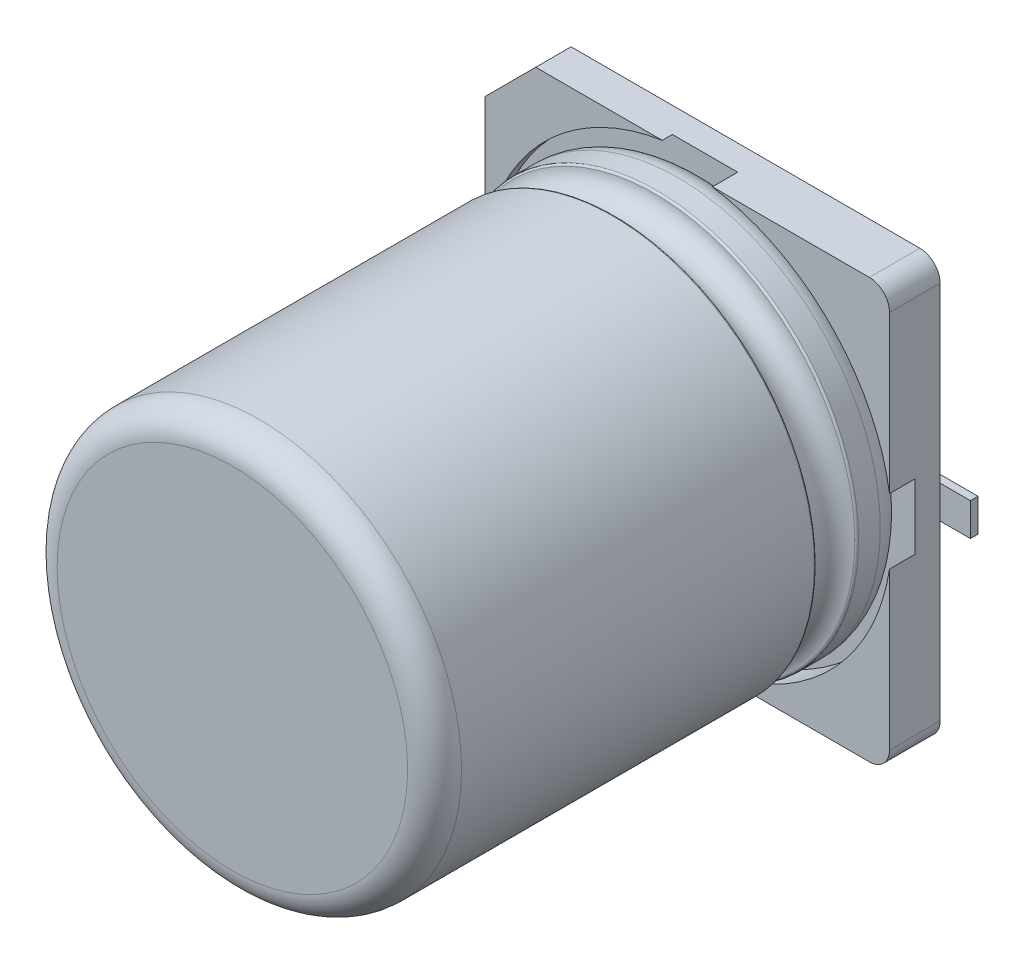
ISO-10303-21;
HEADER;
FILE_DESCRIPTION(('STEP AP214'),'2;1');
FILE_NAME('part.step','',(''),(''),'','','');
FILE_SCHEMA(('AUTOMOTIVE_DESIGN { 1 0 10303 214 1 1 1 1 }'));
ENDSEC;
DATA;
#1=APPLICATION_CONTEXT('core data for automotive mechanical design processes');
#2=APPLICATION_PROTOCOL_DEFINITION('international standard','automotive_design',2000,#1);
#3=PRODUCT_CONTEXT('',#1,'mechanical');
#4=PRODUCT('Part','Part','',(#3));
#5=PRODUCT_RELATED_PRODUCT_CATEGORY('part','',(#4));
#6=PRODUCT_DEFINITION_FORMATION('','',#4);
#7=PRODUCT_DEFINITION_CONTEXT('part definition',#1,'design');
#8=PRODUCT_DEFINITION('design','',#6,#7);
#9=PRODUCT_DEFINITION_SHAPE('','',#8);
#10=(LENGTH_UNIT() NAMED_UNIT(*) SI_UNIT(.MILLI.,.METRE.));
#11=(NAMED_UNIT(*) PLANE_ANGLE_UNIT() SI_UNIT($,.RADIAN.));
#12=(NAMED_UNIT(*) SI_UNIT($,.STERADIAN.) SOLID_ANGLE_UNIT());
#13=UNCERTAINTY_MEASURE_WITH_UNIT(LENGTH_MEASURE(1.E-05),#10,'distance_accuracy_value','');
#14=(GEOMETRIC_REPRESENTATION_CONTEXT(3) GLOBAL_UNCERTAINTY_ASSIGNED_CONTEXT((#13)) GLOBAL_UNIT_ASSIGNED_CONTEXT((#10,
#11,#12)) REPRESENTATION_CONTEXT('',''));
#15=CARTESIAN_POINT('',(0.,0.,0.));
#16=DIRECTION('',(0.,0.,1.));
#17=DIRECTION('',(1.,0.,0.));
#18=AXIS2_PLACEMENT_3D('',#15,#16,#17);
#19=CARTESIAN_POINT('',(0.,0.,2.45));
#20=DIRECTION('',(0.,0.,-1.));
#21=DIRECTION('',(-1.,0.,0.));
#22=AXIS2_PLACEMENT_3D('',#19,#20,#21);
#23=CYLINDRICAL_SURFACE('',#22,4.);
#24=CARTESIAN_POINT('',(0.,0.,9.466666666677));
#25=DIRECTION('',(0.,0.,-1.));
#26=DIRECTION('',(-1.,0.,0.));
#27=AXIS2_PLACEMENT_3D('',#24,#25,#26);
#28=CIRCLE('',#27,4.);
#29=CARTESIAN_POINT('',(-4.00000000001,1.00004898587197E-11,9.466666666677));
#30=VERTEX_POINT('',#29);
#31=EDGE_CURVE('E29',#30,#30,#28,.T.);
#32=ORIENTED_EDGE('',*,*,#31,.T.);
#33=EDGE_LOOP('',(#32));
#34=FACE_BOUND('',#33,.T.);
#35=CARTESIAN_POINT('',(0.,0.,2.48817804600402));
#36=DIRECTION('',(0.,0.,-1.));
#37=DIRECTION('',(-1.,-4.06789841388464E-12,0.));
#38=AXIS2_PLACEMENT_3D('',#35,#36,#37);
#39=CIRCLE('',#38,3.99998270484787);
#40=CARTESIAN_POINT('',(-3.99998299098902,-1.62657901973409E-11,2.488178046004));
#41=VERTEX_POINT('',#40);
#42=EDGE_CURVE('E333',#41,#41,#39,.T.);
#43=ORIENTED_EDGE('',*,*,#42,.F.);
#44=EDGE_LOOP('',(#43));
#45=FACE_BOUND('',#44,.T.);
#46=ADVANCED_FACE('F17',(#34,#45),#23,.T.);
#47=CARTESIAN_POINT('',(0.,0.,10.));
#48=DIRECTION('',(0.,0.,-1.));
#49=DIRECTION('',(0.,-1.,0.));
#50=AXIS2_PLACEMENT_3D('',#47,#48,#49);
#51=PLANE('',#50);
#52=CARTESIAN_POINT('',(0.,0.,10.00000000001));
#53=DIRECTION('',(0.,0.,-1.));
#54=DIRECTION('',(-1.,0.,0.));
#55=AXIS2_PLACEMENT_3D('',#52,#53,#54);
#56=CIRCLE('',#55,3.4666667);
#57=CARTESIAN_POINT('',(-3.466666666677,1.00004245442237E-11,10.00000000001));
#58=VERTEX_POINT('',#57);
#59=EDGE_CURVE('E11',#58,#58,#56,.T.);
#60=ORIENTED_EDGE('',*,*,#59,.F.);
#61=EDGE_LOOP('',(#60));
#62=FACE_BOUND('',#61,.T.);
#63=ADVANCED_FACE('F709',(#62),#51,.F.);
#64=CARTESIAN_POINT('',(3.000096934556,0.,0.));
#65=DIRECTION('',(0.,0.,1.));
#66=DIRECTION('',(1.,0.,0.));
#67=AXIS2_PLACEMENT_3D('',#64,#65,#66);
#68=PLANE('',#67);
#69=DIRECTION('',(1.,0.,0.));
#70=VECTOR('',#69,1.);
#71=CARTESIAN_POINT('',(1.42500000001,-0.32500000001,0.));
#72=LINE('',#71,#70);
#73=CARTESIAN_POINT('',(1.425,-0.325,0.));
#74=VERTEX_POINT('',#73);
#75=CARTESIAN_POINT('',(4.75,-0.325,0.));
#76=VERTEX_POINT('',#75);
#77=EDGE_CURVE('E505',#74,#76,#72,.T.);
#78=ORIENTED_EDGE('',*,*,#77,.F.);
#79=CARTESIAN_POINT('',(1.42500000001,-1.0000404535489E-11,0.));
#80=DIRECTION('',(0.,0.,1.));
#81=DIRECTION('',(0.,1.,0.));
#82=AXIS2_PLACEMENT_3D('',#79,#80,#81);
#83=CIRCLE('',#82,0.325);
#84=CARTESIAN_POINT('',(1.425,0.325,0.));
#85=VERTEX_POINT('',#84);
#86=EDGE_CURVE('E438',#85,#74,#83,.T.);
#87=ORIENTED_EDGE('',*,*,#86,.F.);
#88=DIRECTION('',(-1.,0.,0.));
#89=VECTOR('',#88,1.);
#90=CARTESIAN_POINT('',(4.75000000001,0.32500000001,0.));
#91=LINE('',#90,#89);
#92=CARTESIAN_POINT('',(4.75,0.325,0.));
#93=VERTEX_POINT('',#92);
#94=EDGE_CURVE('E408',#93,#85,#91,.T.);
#95=ORIENTED_EDGE('',*,*,#94,.F.);
#96=DIRECTION('',(0.,1.,0.));
#97=VECTOR('',#96,1.);
#98=CARTESIAN_POINT('',(4.75000000001,-0.32500000001,0.));
#99=LINE('',#98,#97);
#100=EDGE_CURVE('E311',#76,#93,#99,.T.);
#101=ORIENTED_EDGE('',*,*,#100,.F.);
#102=EDGE_LOOP('',(#78,#87,#95,#101));
#103=FACE_BOUND('',#102,.T.);
#104=ADVANCED_FACE('F714',(#103),#68,.F.);
#105=CARTESIAN_POINT('',(-3.000096934556,0.,0.));
#106=DIRECTION('',(0.,0.,1.));
#107=DIRECTION('',(1.,0.,0.));
#108=AXIS2_PLACEMENT_3D('',#105,#106,#107);
#109=PLANE('',#108);
#110=DIRECTION('',(-1.,0.,0.));
#111=VECTOR('',#110,1.);
#112=CARTESIAN_POINT('',(-1.42500000001,0.32500000001,0.));
#113=LINE('',#112,#111);
#114=CARTESIAN_POINT('',(-1.425,0.325,0.));
#115=VERTEX_POINT('',#114);
#116=CARTESIAN_POINT('',(-4.75,0.325,0.));
#117=VERTEX_POINT('',#116);
#118=EDGE_CURVE('E419',#115,#117,#113,.T.);
#119=ORIENTED_EDGE('',*,*,#118,.F.);
#120=CARTESIAN_POINT('',(-1.42500000001,1.00002300233201E-11,0.));
#121=DIRECTION('',(0.,0.,1.));
#122=DIRECTION('',(0.,-1.,0.));
#123=AXIS2_PLACEMENT_3D('',#120,#121,#122);
#124=CIRCLE('',#123,0.325);
#125=CARTESIAN_POINT('',(-1.425,-0.325,0.));
#126=VERTEX_POINT('',#125);
#127=EDGE_CURVE('E355',#126,#115,#124,.T.);
#128=ORIENTED_EDGE('',*,*,#127,.F.);
#129=DIRECTION('',(1.,0.,0.));
#130=VECTOR('',#129,1.);
#131=CARTESIAN_POINT('',(-4.75000000001,-0.32500000001,0.));
#132=LINE('',#131,#130);
#133=CARTESIAN_POINT('',(-4.75,-0.325,0.));
#134=VERTEX_POINT('',#133);
#135=EDGE_CURVE('E354',#134,#126,#132,.T.);
#136=ORIENTED_EDGE('',*,*,#135,.F.);
#137=DIRECTION('',(0.,-1.,0.));
#138=VECTOR('',#137,1.);
#139=CARTESIAN_POINT('',(-4.75000000001,0.32500000001,0.));
#140=LINE('',#139,#138);
#141=EDGE_CURVE('E314',#117,#134,#140,.T.);
#142=ORIENTED_EDGE('',*,*,#141,.F.);
#143=EDGE_LOOP('',(#119,#128,#136,#142));
#144=FACE_BOUND('',#143,.T.);
#145=ADVANCED_FACE('F661',(#144),#109,.F.);
#146=CARTESIAN_POINT('',(0.,0.,9.466666666667));
#147=DIRECTION('',(0.,0.,1.));
#148=DIRECTION('',(-1.,0.,0.));
#149=AXIS2_PLACEMENT_3D('',#146,#147,#148);
#150=TOROIDAL_SURFACE('',#149,3.4666667,0.5333333);
#151=ORIENTED_EDGE('',*,*,#59,.T.);
#152=EDGE_LOOP('',(#151));
#153=FACE_BOUND('',#152,.T.);
#154=ORIENTED_EDGE('',*,*,#31,.F.);
#155=EDGE_LOOP('',(#154));
#156=FACE_BOUND('',#155,.T.);
#157=ADVANCED_FACE('F721',(#153,#156),#150,.T.);
#158=CARTESIAN_POINT('',(4.75,-0.325,0.));
#159=DIRECTION('',(-1.,0.,0.));
#160=DIRECTION('',(0.,0.,1.));
#161=AXIS2_PLACEMENT_3D('',#158,#159,#160);
#162=PLANE('',#161);
#163=ORIENTED_EDGE('',*,*,#100,.T.);
#164=DIRECTION('',(0.,0.,1.));
#165=VECTOR('',#164,1.);
#166=CARTESIAN_POINT('',(4.75000000001,0.32500000001,0.));
#167=LINE('',#166,#165);
#168=CARTESIAN_POINT('',(4.75,0.325,0.15));
#169=VERTEX_POINT('',#168);
#170=EDGE_CURVE('E447',#93,#169,#167,.T.);
#171=ORIENTED_EDGE('',*,*,#170,.T.);
#172=DIRECTION('',(0.,1.,0.));
#173=VECTOR('',#172,1.);
#174=CARTESIAN_POINT('',(4.75000000001,-0.32500000001,0.15000000001));
#175=LINE('',#174,#173);
#176=CARTESIAN_POINT('',(4.75,-0.325,0.15));
#177=VERTEX_POINT('',#176);
#178=EDGE_CURVE('E468',#177,#169,#175,.T.);
#179=ORIENTED_EDGE('',*,*,#178,.F.);
#180=DIRECTION('',(0.,0.,1.));
#181=VECTOR('',#180,1.);
#182=CARTESIAN_POINT('',(4.75000000001,-0.32500000001,0.));
#183=LINE('',#182,#181);
#184=EDGE_CURVE('E506',#76,#177,#183,.T.);
#185=ORIENTED_EDGE('',*,*,#184,.F.);
#186=EDGE_LOOP('',(#163,#171,#179,#185));
#187=FACE_BOUND('',#186,.T.);
#188=ADVANCED_FACE('F381',(#187),#162,.F.);
#189=CARTESIAN_POINT('',(-4.75,0.325,0.));
#190=DIRECTION('',(1.,0.,0.));
#191=DIRECTION('',(0.,-1.,0.));
#192=AXIS2_PLACEMENT_3D('',#189,#190,#191);
#193=PLANE('',#192);
#194=ORIENTED_EDGE('',*,*,#141,.T.);
#195=DIRECTION('',(0.,0.,1.));
#196=VECTOR('',#195,1.);
#197=CARTESIAN_POINT('',(-4.75000000001,-0.32500000001,0.));
#198=LINE('',#197,#196);
#199=CARTESIAN_POINT('',(-4.75,-0.325,0.15));
#200=VERTEX_POINT('',#199);
#201=EDGE_CURVE('E434',#134,#200,#198,.T.);
#202=ORIENTED_EDGE('',*,*,#201,.T.);
#203=DIRECTION('',(0.,-1.,0.));
#204=VECTOR('',#203,1.);
#205=CARTESIAN_POINT('',(-4.75000000001,0.32500000001,0.15000000001));
#206=LINE('',#205,#204);
#207=CARTESIAN_POINT('',(-4.75,0.325,0.15));
#208=VERTEX_POINT('',#207);
#209=EDGE_CURVE('E496',#208,#200,#206,.T.);
#210=ORIENTED_EDGE('',*,*,#209,.F.);
#211=DIRECTION('',(0.,0.,1.));
#212=VECTOR('',#211,1.);
#213=CARTESIAN_POINT('',(-4.75000000001,0.32500000001,0.));
#214=LINE('',#213,#212);
#215=EDGE_CURVE('E310',#117,#208,#214,.T.);
#216=ORIENTED_EDGE('',*,*,#215,.F.);
#217=EDGE_LOOP('',(#194,#202,#210,#216));
#218=FACE_BOUND('',#217,.T.);
#219=ADVANCED_FACE('F666',(#218),#193,.F.);
#220=CARTESIAN_POINT('',(1.425,-0.325,0.));
#221=DIRECTION('',(0.,1.,0.));
#222=DIRECTION('',(0.,0.,-1.));
#223=AXIS2_PLACEMENT_3D('',#220,#221,#222);
#224=PLANE('',#223);
#225=ORIENTED_EDGE('',*,*,#77,.T.);
#226=ORIENTED_EDGE('',*,*,#184,.T.);
#227=DIRECTION('',(1.,0.,0.));
#228=VECTOR('',#227,1.);
#229=CARTESIAN_POINT('',(1.42500000001,-0.32500000001,0.15000000001));
#230=LINE('',#229,#228);
#231=CARTESIAN_POINT('',(4.15,-0.325,0.15));
#232=VERTEX_POINT('',#231);
#233=EDGE_CURVE('E571',#232,#177,#230,.T.);
#234=ORIENTED_EDGE('',*,*,#233,.F.);
#235=DIRECTION('',(1.,0.,0.));
#236=VECTOR('',#235,1.);
#237=CARTESIAN_POINT('',(1.42500000001,-0.32500000001,0.15000000001));
#238=LINE('',#237,#236);
#239=CARTESIAN_POINT('',(1.425,-0.325,0.15));
#240=VERTEX_POINT('',#239);
#241=EDGE_CURVE('E458',#240,#232,#238,.T.);
#242=ORIENTED_EDGE('',*,*,#241,.F.);
#243=DIRECTION('',(0.,0.,1.));
#244=VECTOR('',#243,1.);
#245=CARTESIAN_POINT('',(1.42500000001,-0.32500000001,0.));
#246=LINE('',#245,#244);
#247=EDGE_CURVE('E502',#74,#240,#246,.T.);
#248=ORIENTED_EDGE('',*,*,#247,.F.);
#249=EDGE_LOOP('',(#225,#226,#234,#242,#248));
#250=FACE_BOUND('',#249,.T.);
#251=ADVANCED_FACE('F932',(#250),#224,.F.);
#252=CARTESIAN_POINT('',(1.425,0.,0.));
#253=DIRECTION('',(0.,0.,1.));
#254=DIRECTION('',(0.,1.,0.));
#255=AXIS2_PLACEMENT_3D('',#252,#253,#254);
#256=CYLINDRICAL_SURFACE('',#255,0.325);
#257=ORIENTED_EDGE('',*,*,#86,.T.);
#258=ORIENTED_EDGE('',*,*,#247,.T.);
#259=CARTESIAN_POINT('',(1.42500000001,-1.0000404535489E-11,0.15000000001));
#260=DIRECTION('',(0.,0.,1.));
#261=DIRECTION('',(0.,1.,0.));
#262=AXIS2_PLACEMENT_3D('',#259,#260,#261);
#263=CIRCLE('',#262,0.325);
#264=CARTESIAN_POINT('',(1.425,0.325,0.15));
#265=VERTEX_POINT('',#264);
#266=EDGE_CURVE('E479',#265,#240,#263,.T.);
#267=ORIENTED_EDGE('',*,*,#266,.F.);
#268=DIRECTION('',(0.,0.,1.));
#269=VECTOR('',#268,1.);
#270=CARTESIAN_POINT('',(1.42500000001,0.32500000001,0.));
#271=LINE('',#270,#269);
#272=EDGE_CURVE('E404',#85,#265,#271,.T.);
#273=ORIENTED_EDGE('',*,*,#272,.F.);
#274=EDGE_LOOP('',(#257,#258,#267,#273));
#275=FACE_BOUND('',#274,.T.);
#276=ADVANCED_FACE('F927',(#275),#256,.T.);
#277=CARTESIAN_POINT('',(-4.75,-0.325,0.));
#278=DIRECTION('',(0.,1.,0.));
#279=DIRECTION('',(0.,0.,-1.));
#280=AXIS2_PLACEMENT_3D('',#277,#278,#279);
#281=PLANE('',#280);
#282=ORIENTED_EDGE('',*,*,#135,.T.);
#283=DIRECTION('',(0.,0.,1.));
#284=VECTOR('',#283,1.);
#285=CARTESIAN_POINT('',(-1.42500000001,-0.32500000001,0.));
#286=LINE('',#285,#284);
#287=CARTESIAN_POINT('',(-1.425,-0.325,0.15));
#288=VERTEX_POINT('',#287);
#289=EDGE_CURVE('E414',#126,#288,#286,.T.);
#290=ORIENTED_EDGE('',*,*,#289,.T.);
#291=DIRECTION('',(1.,0.,0.));
#292=VECTOR('',#291,1.);
#293=CARTESIAN_POINT('',(-4.75000000001,-0.32500000001,0.15000000001));
#294=LINE('',#293,#292);
#295=CARTESIAN_POINT('',(-4.15,-0.325,0.15));
#296=VERTEX_POINT('',#295);
#297=EDGE_CURVE('E415',#296,#288,#294,.T.);
#298=ORIENTED_EDGE('',*,*,#297,.F.);
#299=DIRECTION('',(1.,0.,0.));
#300=VECTOR('',#299,1.);
#301=CARTESIAN_POINT('',(-4.75000000001,-0.32500000001,0.15000000001));
#302=LINE('',#301,#300);
#303=EDGE_CURVE('E500',#200,#296,#302,.T.);
#304=ORIENTED_EDGE('',*,*,#303,.F.);
#305=ORIENTED_EDGE('',*,*,#201,.F.);
#306=EDGE_LOOP('',(#282,#290,#298,#304,#305));
#307=FACE_BOUND('',#306,.T.);
#308=ADVANCED_FACE('F676',(#307),#281,.F.);
#309=CARTESIAN_POINT('',(0.,0.,1.183333333333));
#310=DIRECTION('',(0.,0.,-1.));
#311=DIRECTION('',(-1.,0.,0.));
#312=AXIS2_PLACEMENT_3D('',#309,#310,#311);
#313=TOROIDAL_SURFACE('',#312,3.4666667,0.5333333);
#314=CARTESIAN_POINT('',(0.,0.,0.65000000001));
#315=DIRECTION('',(0.,0.,-1.));
#316=DIRECTION('',(-1.,0.,0.));
#317=AXIS2_PLACEMENT_3D('',#314,#315,#316);
#318=CIRCLE('',#317,3.4666667);
#319=CARTESIAN_POINT('',(-3.466666666677,1.00004245442237E-11,0.65000000001));
#320=VERTEX_POINT('',#319);
#321=EDGE_CURVE('E351',#320,#320,#318,.T.);
#322=ORIENTED_EDGE('',*,*,#321,.F.);
#323=EDGE_LOOP('',(#322));
#324=FACE_BOUND('',#323,.T.);
#325=CARTESIAN_POINT('',(0.,0.,1.183333333343));
#326=DIRECTION('',(0.,0.,-1.));
#327=DIRECTION('',(-1.,0.,0.));
#328=AXIS2_PLACEMENT_3D('',#325,#326,#327);
#329=CIRCLE('',#328,4.);
#330=CARTESIAN_POINT('',(-4.00000000001,1.00004898587197E-11,1.183333333343));
#331=VERTEX_POINT('',#330);
#332=EDGE_CURVE('E439',#331,#331,#329,.T.);
#333=ORIENTED_EDGE('',*,*,#332,.T.);
#334=EDGE_LOOP('',(#333));
#335=FACE_BOUND('',#334,.T.);
#336=ADVANCED_FACE('F693',(#324,#335),#313,.T.);
#337=CARTESIAN_POINT('',(0.,0.,0.65));
#338=DIRECTION('',(0.,0.,1.));
#339=DIRECTION('',(0.,-1.,0.));
#340=AXIS2_PLACEMENT_3D('',#337,#338,#339);
#341=PLANE('',#340);
#342=ORIENTED_EDGE('',*,*,#321,.T.);
#343=EDGE_LOOP('',(#342));
#344=FACE_BOUND('',#343,.T.);
#345=DIRECTION('',(0.,-1.,0.));
#346=VECTOR('',#345,1.);
#347=CARTESIAN_POINT('',(-4.15000000001,1.57500000001,0.65000000001));
#348=LINE('',#347,#346);
#349=CARTESIAN_POINT('',(-4.15,0.646142399166,0.65));
#350=VERTEX_POINT('',#349);
#351=CARTESIAN_POINT('',(-4.15,-0.646142399166,0.65));
#352=VERTEX_POINT('',#351);
#353=EDGE_CURVE('E269',#350,#352,#348,.T.);
#354=ORIENTED_EDGE('',*,*,#353,.T.);
#355=CARTESIAN_POINT('',(0.,0.,0.65000000001));
#356=DIRECTION('',(0.,0.,1.));
#357=DIRECTION('',(-1.,0.,0.));
#358=AXIS2_PLACEMENT_3D('',#355,#356,#357);
#359=CIRCLE('',#358,4.2);
#360=CARTESIAN_POINT('',(-0.646142399166,-4.15,0.65));
#361=VERTEX_POINT('',#360);
#362=EDGE_CURVE('E280',#352,#361,#359,.T.);
#363=ORIENTED_EDGE('',*,*,#362,.T.);
#364=DIRECTION('',(1.,0.,0.));
#365=VECTOR('',#364,1.);
#366=CARTESIAN_POINT('',(-1.57500000001,-4.15000000001,0.65000000001));
#367=LINE('',#366,#365);
#368=CARTESIAN_POINT('',(0.646142399166,-4.15,0.65));
#369=VERTEX_POINT('',#368);
#370=EDGE_CURVE('E295',#361,#369,#367,.T.);
#371=ORIENTED_EDGE('',*,*,#370,.T.);
#372=CARTESIAN_POINT('',(0.,0.,0.65000000001));
#373=DIRECTION('',(0.,0.,1.));
#374=DIRECTION('',(-1.,0.,0.));
#375=AXIS2_PLACEMENT_3D('',#372,#373,#374);
#376=CIRCLE('',#375,4.2);
#377=CARTESIAN_POINT('',(4.15,-0.646142399166,0.65));
#378=VERTEX_POINT('',#377);
#379=EDGE_CURVE('E494',#369,#378,#376,.T.);
#380=ORIENTED_EDGE('',*,*,#379,.T.);
#381=DIRECTION('',(0.,1.,0.));
#382=VECTOR('',#381,1.);
#383=CARTESIAN_POINT('',(4.15000000001,-2.07500000001,0.65000000001));
#384=LINE('',#383,#382);
#385=CARTESIAN_POINT('',(4.15,0.646142399166,0.65));
#386=VERTEX_POINT('',#385);
#387=EDGE_CURVE('E495',#378,#386,#384,.T.);
#388=ORIENTED_EDGE('',*,*,#387,.T.);
#389=CARTESIAN_POINT('',(0.,0.,0.65000000001));
#390=DIRECTION('',(0.,0.,1.));
#391=DIRECTION('',(-1.,0.,0.));
#392=AXIS2_PLACEMENT_3D('',#389,#390,#391);
#393=CIRCLE('',#392,4.2);
#394=CARTESIAN_POINT('',(0.646142399166,4.15,0.65));
#395=VERTEX_POINT('',#394);
#396=EDGE_CURVE('E276',#386,#395,#393,.T.);
#397=ORIENTED_EDGE('',*,*,#396,.T.);
#398=DIRECTION('',(-1.,0.,0.));
#399=VECTOR('',#398,1.);
#400=CARTESIAN_POINT('',(2.07500000001,4.15000000001,0.65000000001));
#401=LINE('',#400,#399);
#402=CARTESIAN_POINT('',(-0.646142399166,4.15,0.65));
#403=VERTEX_POINT('',#402);
#404=EDGE_CURVE('E272',#395,#403,#401,.T.);
#405=ORIENTED_EDGE('',*,*,#404,.T.);
#406=CARTESIAN_POINT('',(0.,0.,0.65000000001));
#407=DIRECTION('',(0.,0.,1.));
#408=DIRECTION('',(-1.,0.,0.));
#409=AXIS2_PLACEMENT_3D('',#406,#407,#408);
#410=CIRCLE('',#409,4.2);
#411=EDGE_CURVE('E259',#403,#350,#410,.T.);
#412=ORIENTED_EDGE('',*,*,#411,.T.);
#413=EDGE_LOOP('',(#354,#363,#371,#380,#388,#397,#405,#412));
#414=FACE_BOUND('',#413,.T.);
#415=ADVANCED_FACE('F273',(#344,#414),#341,.T.);
#416=CARTESIAN_POINT('',(0.,0.,2.05000000001));
#417=DIRECTION('',(0.,0.,1.));
#418=DIRECTION('',(1.,0.,0.));
#419=AXIS2_PLACEMENT_3D('',#416,#417,#418);
#420=TOROIDAL_SURFACE('',#419,4.,0.4);
#421=CARTESIAN_POINT('',(0.,0.,2.448343678196));
#422=DIRECTION('',(0.,0.,-1.));
#423=DIRECTION('',(-1.,0.,0.));
#424=AXIS2_PLACEMENT_3D('',#421,#422,#423);
#425=CIRCLE('',#424,3.9636362);
#426=CARTESIAN_POINT('',(-3.963636363646,1.00004854068332E-11,2.448343678196));
#427=VERTEX_POINT('',#426);
#428=EDGE_CURVE('E330',#427,#427,#425,.T.);
#429=ORIENTED_EDGE('',*,*,#428,.T.);
#430=EDGE_LOOP('',(#429));
#431=FACE_BOUND('',#430,.T.);
#432=CARTESIAN_POINT('',(0.,0.,1.651656321824));
#433=DIRECTION('',(0.,0.,-1.));
#434=DIRECTION('',(-1.,0.,0.));
#435=AXIS2_PLACEMENT_3D('',#432,#433,#434);
#436=CIRCLE('',#435,3.9636362);
#437=CARTESIAN_POINT('',(-3.963636363646,1.00004854068332E-11,1.651656321824));
#438=VERTEX_POINT('',#437);
#439=EDGE_CURVE('E433',#438,#438,#436,.T.);
#440=ORIENTED_EDGE('',*,*,#439,.F.);
#441=EDGE_LOOP('',(#440));
#442=FACE_BOUND('',#441,.T.);
#443=ADVANCED_FACE('F19',(#431,#442),#420,.F.);
#444=CARTESIAN_POINT('',(-4.15,3.15,0.15));
#445=DIRECTION('',(1.,0.,0.));
#446=DIRECTION('',(0.,-1.,0.));
#447=AXIS2_PLACEMENT_3D('',#444,#445,#446);
#448=PLANE('',#447);
#449=DIRECTION('',(0.,-1.,0.));
#450=VECTOR('',#449,1.);
#451=CARTESIAN_POINT('',(-4.15000000001,3.15000000001,0.15000000001));
#452=LINE('',#451,#450);
#453=CARTESIAN_POINT('',(-4.15,0.325,0.15));
#454=VERTEX_POINT('',#453);
#455=EDGE_CURVE('E426',#454,#296,#452,.T.);
#456=ORIENTED_EDGE('',*,*,#455,.T.);
#457=DIRECTION('',(0.,-1.,0.));
#458=VECTOR('',#457,1.);
#459=CARTESIAN_POINT('',(-4.15000000001,3.15000000001,0.15000000001));
#460=LINE('',#459,#458);
#461=CARTESIAN_POINT('',(-4.15,-3.15,0.15));
#462=VERTEX_POINT('',#461);
#463=EDGE_CURVE('E418',#296,#462,#460,.T.);
#464=ORIENTED_EDGE('',*,*,#463,.T.);
#465=DIRECTION('',(0.,0.,1.));
#466=VECTOR('',#465,1.);
#467=CARTESIAN_POINT('',(-4.15000000001,-3.15000000001,0.15000000001));
#468=LINE('',#467,#466);
#469=CARTESIAN_POINT('',(-4.15,-3.15,0.85));
#470=VERTEX_POINT('',#469);
#471=EDGE_CURVE('E471',#462,#470,#468,.T.);
#472=ORIENTED_EDGE('',*,*,#471,.T.);
#473=DIRECTION('',(0.,-1.,0.));
#474=VECTOR('',#473,1.);
#475=CARTESIAN_POINT('',(-4.15000000001,4.15000000001,0.85000000001));
#476=LINE('',#475,#474);
#477=CARTESIAN_POINT('',(-4.15,-0.646142399166,0.85));
#478=VERTEX_POINT('',#477);
#479=EDGE_CURVE('E335',#478,#470,#476,.T.);
#480=ORIENTED_EDGE('',*,*,#479,.F.);
#481=DIRECTION('',(0.,0.,-1.));
#482=VECTOR('',#481,1.);
#483=CARTESIAN_POINT('',(-4.15000000001,-0.646142399176,0.65000000001));
#484=LINE('',#483,#482);
#485=EDGE_CURVE('E323',#478,#352,#484,.T.);
#486=ORIENTED_EDGE('',*,*,#485,.T.);
#487=ORIENTED_EDGE('',*,*,#353,.F.);
#488=DIRECTION('',(0.,0.,-1.));
#489=VECTOR('',#488,1.);
#490=CARTESIAN_POINT('',(-4.15000000001,0.646142399176,0.65000000001));
#491=LINE('',#490,#489);
#492=CARTESIAN_POINT('',(-4.15,0.646142399166,0.85));
#493=VERTEX_POINT('',#492);
#494=EDGE_CURVE('E266',#493,#350,#491,.T.);
#495=ORIENTED_EDGE('',*,*,#494,.F.);
#496=DIRECTION('',(0.,-1.,0.));
#497=VECTOR('',#496,1.);
#498=CARTESIAN_POINT('',(-4.15000000001,4.15000000001,0.85000000001));
#499=LINE('',#498,#497);
#500=CARTESIAN_POINT('',(-4.15,3.15,0.85));
#501=VERTEX_POINT('',#500);
#502=EDGE_CURVE('E501',#501,#493,#499,.T.);
#503=ORIENTED_EDGE('',*,*,#502,.F.);
#504=DIRECTION('',(0.,0.,1.));
#505=VECTOR('',#504,1.);
#506=CARTESIAN_POINT('',(-4.15000000001,3.15000000001,0.15000000001));
#507=LINE('',#506,#505);
#508=CARTESIAN_POINT('',(-4.15,3.15,0.15));
#509=VERTEX_POINT('',#508);
#510=EDGE_CURVE('E350',#509,#501,#507,.T.);
#511=ORIENTED_EDGE('',*,*,#510,.F.);
#512=DIRECTION('',(0.,-1.,0.));
#513=VECTOR('',#512,1.);
#514=CARTESIAN_POINT('',(-4.15000000001,3.15000000001,0.15000000001));
#515=LINE('',#514,#513);
#516=EDGE_CURVE('E344',#509,#454,#515,.T.);
#517=ORIENTED_EDGE('',*,*,#516,.T.);
#518=EDGE_LOOP('',(#456,#464,#472,#480,#486,#487,#495,#503,#511,#517));
#519=FACE_BOUND('',#518,.T.);
#520=ADVANCED_FACE('F910',(#519),#448,.F.);
#521=CARTESIAN_POINT('',(0.,0.,0.65));
#522=DIRECTION('',(0.,0.,1.));
#523=DIRECTION('',(-1.,0.,0.));
#524=AXIS2_PLACEMENT_3D('',#521,#522,#523);
#525=CYLINDRICAL_SURFACE('',#524,4.2);
#526=CARTESIAN_POINT('',(0.,0.,0.85000000001));
#527=DIRECTION('',(0.,0.,-1.));
#528=DIRECTION('',(-1.,0.,0.));
#529=AXIS2_PLACEMENT_3D('',#526,#527,#528);
#530=CIRCLE('',#529,4.2);
#531=CARTESIAN_POINT('',(-0.646142399166,4.15,0.85));
#532=VERTEX_POINT('',#531);
#533=EDGE_CURVE('E338',#493,#532,#530,.T.);
#534=ORIENTED_EDGE('',*,*,#533,.F.);
#535=ORIENTED_EDGE('',*,*,#494,.T.);
#536=ORIENTED_EDGE('',*,*,#411,.F.);
#537=DIRECTION('',(0.,0.,-1.));
#538=VECTOR('',#537,1.);
#539=CARTESIAN_POINT('',(-0.646142399176,4.15000000001,0.65000000001));
#540=LINE('',#539,#538);
#541=EDGE_CURVE('E264',#532,#403,#540,.T.);
#542=ORIENTED_EDGE('',*,*,#541,.F.);
#543=EDGE_LOOP('',(#534,#535,#536,#542));
#544=FACE_BOUND('',#543,.T.);
#545=ADVANCED_FACE('F262',(#544),#525,.F.);
#546=CARTESIAN_POINT('',(0.,0.,0.65));
#547=DIRECTION('',(0.,0.,1.));
#548=DIRECTION('',(-1.,0.,0.));
#549=AXIS2_PLACEMENT_3D('',#546,#547,#548);
#550=CYLINDRICAL_SURFACE('',#549,4.2);
#551=ORIENTED_EDGE('',*,*,#362,.F.);
#552=ORIENTED_EDGE('',*,*,#485,.F.);
#553=CARTESIAN_POINT('',(0.,0.,0.85000000001));
#554=DIRECTION('',(0.,0.,-1.));
#555=DIRECTION('',(-1.,0.,0.));
#556=AXIS2_PLACEMENT_3D('',#553,#554,#555);
#557=CIRCLE('',#556,4.2);
#558=CARTESIAN_POINT('',(-0.646142399166,-4.15,0.85));
#559=VERTEX_POINT('',#558);
#560=EDGE_CURVE('E339',#559,#478,#557,.T.);
#561=ORIENTED_EDGE('',*,*,#560,.F.);
#562=DIRECTION('',(0.,0.,-1.));
#563=VECTOR('',#562,1.);
#564=CARTESIAN_POINT('',(-0.646142399176,-4.15000000001,0.65000000001));
#565=LINE('',#564,#563);
#566=EDGE_CURVE('E288',#559,#361,#565,.T.);
#567=ORIENTED_EDGE('',*,*,#566,.T.);
#568=EDGE_LOOP('',(#551,#552,#561,#567));
#569=FACE_BOUND('',#568,.T.);
#570=ADVANCED_FACE('F849',(#569),#550,.F.);
#571=CARTESIAN_POINT('',(4.15,4.15,0.15));
#572=DIRECTION('',(0.,-1.,0.));
#573=DIRECTION('',(-1.,0.,0.));
#574=AXIS2_PLACEMENT_3D('',#571,#572,#573);
#575=PLANE('',#574);
#576=DIRECTION('',(0.,0.,1.));
#577=VECTOR('',#576,1.);
#578=CARTESIAN_POINT('',(-3.15000000001,4.15000000001,0.15000000001));
#579=LINE('',#578,#577);
#580=CARTESIAN_POINT('',(-3.15,4.15,0.15));
#581=VERTEX_POINT('',#580);
#582=CARTESIAN_POINT('',(-3.15,4.15,0.85));
#583=VERTEX_POINT('',#582);
#584=EDGE_CURVE('E349',#581,#583,#579,.T.);
#585=ORIENTED_EDGE('',*,*,#584,.T.);
#586=DIRECTION('',(-1.,0.,0.));
#587=VECTOR('',#586,1.);
#588=CARTESIAN_POINT('',(1.00005082284216E-11,4.15000000001,0.85000000001));
#589=LINE('',#588,#587);
#590=EDGE_CURVE('E285',#532,#583,#589,.T.);
#591=ORIENTED_EDGE('',*,*,#590,.F.);
#592=ORIENTED_EDGE('',*,*,#541,.T.);
#593=ORIENTED_EDGE('',*,*,#404,.F.);
#594=DIRECTION('',(0.,0.,-1.));
#595=VECTOR('',#594,1.);
#596=CARTESIAN_POINT('',(0.646142399176,4.15000000001,0.65000000001));
#597=LINE('',#596,#595);
#598=CARTESIAN_POINT('',(0.646142399166,4.15,1.15));
#599=VERTEX_POINT('',#598);
#600=EDGE_CURVE('E317',#599,#395,#597,.T.);
#601=ORIENTED_EDGE('',*,*,#600,.F.);
#602=DIRECTION('',(-1.,0.,0.));
#603=VECTOR('',#602,1.);
#604=CARTESIAN_POINT('',(4.15000000001,4.15000000001,1.15000000001));
#605=LINE('',#604,#603);
#606=CARTESIAN_POINT('',(3.75,4.15,1.15));
#607=VERTEX_POINT('',#606);
#608=EDGE_CURVE('E524',#607,#599,#605,.T.);
#609=ORIENTED_EDGE('',*,*,#608,.F.);
#610=DIRECTION('',(0.,0.,1.));
#611=VECTOR('',#610,1.);
#612=CARTESIAN_POINT('',(3.75000000001,4.15000000001,0.15000000001));
#613=LINE('',#612,#611);
#614=CARTESIAN_POINT('',(3.75,4.15,0.15));
#615=VERTEX_POINT('',#614);
#616=EDGE_CURVE('E300',#615,#607,#613,.T.);
#617=ORIENTED_EDGE('',*,*,#616,.F.);
#618=DIRECTION('',(-1.,0.,0.));
#619=VECTOR('',#618,1.);
#620=CARTESIAN_POINT('',(4.15000000001,4.15000000001,0.15000000001));
#621=LINE('',#620,#619);
#622=EDGE_CURVE('E340',#615,#581,#621,.T.);
#623=ORIENTED_EDGE('',*,*,#622,.T.);
#624=EDGE_LOOP('',(#585,#591,#592,#593,#601,#609,#617,#623));
#625=FACE_BOUND('',#624,.T.);
#626=ADVANCED_FACE('F283',(#625),#575,.F.);
#627=CARTESIAN_POINT('',(-3.15,-4.15,0.15));
#628=DIRECTION('',(0.,1.,0.));
#629=DIRECTION('',(0.,0.,-1.));
#630=AXIS2_PLACEMENT_3D('',#627,#628,#629);
#631=PLANE('',#630);
#632=DIRECTION('',(1.,0.,0.));
#633=VECTOR('',#632,1.);
#634=CARTESIAN_POINT('',(-3.15000000001,-4.15000000001,1.15000000001));
#635=LINE('',#634,#633);
#636=CARTESIAN_POINT('',(0.646142399166,-4.15,1.15));
#637=VERTEX_POINT('',#636);
#638=CARTESIAN_POINT('',(3.75,-4.15,1.15));
#639=VERTEX_POINT('',#638);
#640=EDGE_CURVE('E463',#637,#639,#635,.T.);
#641=ORIENTED_EDGE('',*,*,#640,.F.);
#642=DIRECTION('',(0.,0.,-1.));
#643=VECTOR('',#642,1.);
#644=CARTESIAN_POINT('',(0.646142399176,-4.15000000001,0.65000000001));
#645=LINE('',#644,#643);
#646=EDGE_CURVE('E320',#637,#369,#645,.T.);
#647=ORIENTED_EDGE('',*,*,#646,.T.);
#648=ORIENTED_EDGE('',*,*,#370,.F.);
#649=ORIENTED_EDGE('',*,*,#566,.F.);
#650=DIRECTION('',(-1.,0.,0.));
#651=VECTOR('',#650,1.);
#652=CARTESIAN_POINT('',(-1.00005082284216E-11,-4.15000000001,0.85000000001));
#653=LINE('',#652,#651);
#654=CARTESIAN_POINT('',(-3.15,-4.15,0.85));
#655=VERTEX_POINT('',#654);
#656=EDGE_CURVE('E486',#559,#655,#653,.T.);
#657=ORIENTED_EDGE('',*,*,#656,.T.);
#658=DIRECTION('',(0.,0.,1.));
#659=VECTOR('',#658,1.);
#660=CARTESIAN_POINT('',(-3.15000000001,-4.15000000001,0.15000000001));
#661=LINE('',#660,#659);
#662=CARTESIAN_POINT('',(-3.15,-4.15,0.15));
#663=VERTEX_POINT('',#662);
#664=EDGE_CURVE('E544',#663,#655,#661,.T.);
#665=ORIENTED_EDGE('',*,*,#664,.F.);
#666=DIRECTION('',(1.,0.,0.));
#667=VECTOR('',#666,1.);
#668=CARTESIAN_POINT('',(-3.15000000001,-4.15000000001,0.15000000001));
#669=LINE('',#668,#667);
#670=CARTESIAN_POINT('',(3.75,-4.15,0.15));
#671=VERTEX_POINT('',#670);
#672=EDGE_CURVE('E424',#663,#671,#669,.T.);
#673=ORIENTED_EDGE('',*,*,#672,.T.);
#674=DIRECTION('',(0.,0.,1.));
#675=VECTOR('',#674,1.);
#676=CARTESIAN_POINT('',(3.75000000001,-4.15000000001,0.15000000001));
#677=LINE('',#676,#675);
#678=EDGE_CURVE('E462',#671,#639,#677,.T.);
#679=ORIENTED_EDGE('',*,*,#678,.T.);
#680=EDGE_LOOP('',(#641,#647,#648,#649,#657,#665,#673,#679));
#681=FACE_BOUND('',#680,.T.);
#682=ADVANCED_FACE('F848',(#681),#631,.F.);
#683=CARTESIAN_POINT('',(0.,0.,0.65));
#684=DIRECTION('',(0.,0.,1.));
#685=DIRECTION('',(-1.,0.,0.));
#686=AXIS2_PLACEMENT_3D('',#683,#684,#685);
#687=CYLINDRICAL_SURFACE('',#686,4.2);
#688=ORIENTED_EDGE('',*,*,#600,.T.);
#689=ORIENTED_EDGE('',*,*,#396,.F.);
#690=DIRECTION('',(0.,0.,-1.));
#691=VECTOR('',#690,1.);
#692=CARTESIAN_POINT('',(4.15000000001,0.646142399176,0.65000000001));
#693=LINE('',#692,#691);
#694=CARTESIAN_POINT('',(4.15,0.646142399166,1.15));
#695=VERTEX_POINT('',#694);
#696=EDGE_CURVE('E555',#695,#386,#693,.T.);
#697=ORIENTED_EDGE('',*,*,#696,.F.);
#698=CARTESIAN_POINT('',(0.,0.,1.15000000001));
#699=DIRECTION('',(0.,0.,1.));
#700=DIRECTION('',(-1.,0.,0.));
#701=AXIS2_PLACEMENT_3D('',#698,#699,#700);
#702=CIRCLE('',#701,4.2);
#703=EDGE_CURVE('E518',#695,#599,#702,.T.);
#704=ORIENTED_EDGE('',*,*,#703,.T.);
#705=EDGE_LOOP('',(#688,#689,#697,#704));
#706=FACE_BOUND('',#705,.T.);
#707=ADVANCED_FACE('F631',(#706),#687,.F.);
#708=CARTESIAN_POINT('',(0.,0.,0.65));
#709=DIRECTION('',(0.,0.,1.));
#710=DIRECTION('',(-1.,0.,0.));
#711=AXIS2_PLACEMENT_3D('',#708,#709,#710);
#712=CYLINDRICAL_SURFACE('',#711,4.2);
#713=ORIENTED_EDGE('',*,*,#379,.F.);
#714=ORIENTED_EDGE('',*,*,#646,.F.);
#715=CARTESIAN_POINT('',(0.,0.,1.15000000001));
#716=DIRECTION('',(0.,0.,1.));
#717=DIRECTION('',(-1.,0.,0.));
#718=AXIS2_PLACEMENT_3D('',#715,#716,#717);
#719=CIRCLE('',#718,4.2);
#720=CARTESIAN_POINT('',(4.15,-0.646142399166,1.15));
#721=VERTEX_POINT('',#720);
#722=EDGE_CURVE('E328',#637,#721,#719,.T.);
#723=ORIENTED_EDGE('',*,*,#722,.T.);
#724=DIRECTION('',(0.,0.,-1.));
#725=VECTOR('',#724,1.);
#726=CARTESIAN_POINT('',(4.15000000001,-0.646142399176,0.65000000001));
#727=LINE('',#726,#725);
#728=EDGE_CURVE('E490',#721,#378,#727,.T.);
#729=ORIENTED_EDGE('',*,*,#728,.T.);
#730=EDGE_LOOP('',(#713,#714,#723,#729));
#731=FACE_BOUND('',#730,.T.);
#732=ADVANCED_FACE('F877',(#731),#712,.F.);
#733=CARTESIAN_POINT('',(4.15,-4.15,0.15));
#734=DIRECTION('',(-1.,0.,0.));
#735=DIRECTION('',(0.,0.,1.));
#736=AXIS2_PLACEMENT_3D('',#733,#734,#735);
#737=PLANE('',#736);
#738=DIRECTION('',(0.,1.,0.));
#739=VECTOR('',#738,1.);
#740=CARTESIAN_POINT('',(4.15000000001,-4.15000000001,0.15000000001));
#741=LINE('',#740,#739);
#742=CARTESIAN_POINT('',(4.15,0.325,0.15));
#743=VERTEX_POINT('',#742);
#744=EDGE_CURVE('E423',#232,#743,#741,.T.);
#745=ORIENTED_EDGE('',*,*,#744,.T.);
#746=DIRECTION('',(0.,1.,0.));
#747=VECTOR('',#746,1.);
#748=CARTESIAN_POINT('',(4.15000000001,-4.15000000001,0.15000000001));
#749=LINE('',#748,#747);
#750=CARTESIAN_POINT('',(4.15,3.75,0.15));
#751=VERTEX_POINT('',#750);
#752=EDGE_CURVE('E343',#743,#751,#749,.T.);
#753=ORIENTED_EDGE('',*,*,#752,.T.);
#754=DIRECTION('',(0.,0.,1.));
#755=VECTOR('',#754,1.);
#756=CARTESIAN_POINT('',(4.15000000001,3.75000000001,0.15000000001));
#757=LINE('',#756,#755);
#758=CARTESIAN_POINT('',(4.15,3.75,1.15));
#759=VERTEX_POINT('',#758);
#760=EDGE_CURVE('E403',#751,#759,#757,.T.);
#761=ORIENTED_EDGE('',*,*,#760,.T.);
#762=DIRECTION('',(0.,1.,0.));
#763=VECTOR('',#762,1.);
#764=CARTESIAN_POINT('',(4.15000000001,-4.15000000001,1.15000000001));
#765=LINE('',#764,#763);
#766=EDGE_CURVE('E528',#695,#759,#765,.T.);
#767=ORIENTED_EDGE('',*,*,#766,.F.);
#768=ORIENTED_EDGE('',*,*,#696,.T.);
#769=ORIENTED_EDGE('',*,*,#387,.F.);
#770=ORIENTED_EDGE('',*,*,#728,.F.);
#771=DIRECTION('',(0.,1.,0.));
#772=VECTOR('',#771,1.);
#773=CARTESIAN_POINT('',(4.15000000001,-4.15000000001,1.15000000001));
#774=LINE('',#773,#772);
#775=CARTESIAN_POINT('',(4.15,-3.75,1.15));
#776=VERTEX_POINT('',#775);
#777=EDGE_CURVE('E324',#776,#721,#774,.T.);
#778=ORIENTED_EDGE('',*,*,#777,.F.);
#779=DIRECTION('',(0.,0.,1.));
#780=VECTOR('',#779,1.);
#781=CARTESIAN_POINT('',(4.15000000001,-3.75000000001,0.15000000001));
#782=LINE('',#781,#780);
#783=CARTESIAN_POINT('',(4.15,-3.75,0.15));
#784=VERTEX_POINT('',#783);
#785=EDGE_CURVE('E459',#784,#776,#782,.T.);
#786=ORIENTED_EDGE('',*,*,#785,.F.);
#787=DIRECTION('',(0.,1.,0.));
#788=VECTOR('',#787,1.);
#789=CARTESIAN_POINT('',(4.15000000001,-4.15000000001,0.15000000001));
#790=LINE('',#789,#788);
#791=EDGE_CURVE('E334',#784,#232,#790,.T.);
#792=ORIENTED_EDGE('',*,*,#791,.T.);
#793=EDGE_LOOP('',(#745,#753,#761,#767,#768,#769,#770,#778,#786,#792));
#794=FACE_BOUND('',#793,.T.);
#795=ADVANCED_FACE('F380',(#794),#737,.F.);
#796=CARTESIAN_POINT('',(3.96308210152948,-2.6608678483157E-13,2.44829464546874));
#797=CARTESIAN_POINT('',(3.96335066362132,-2.62659762136443E-13,2.44831916182737));
#798=CARTESIAN_POINT('',(3.96361922571316,-2.59232739441316E-13,2.448343678186));
#799=CARTESIAN_POINT('',(3.99998270484852,2.04788327038137E-13,2.451663208837));
#800=CARTESIAN_POINT('',(3.99998270484787,-4.60569082871898E-13,2.48817804600421));
#801=(BOUNDED_CURVE() B_SPLINE_CURVE(2,(#796,#797,#798,#799,#800),.UNSPECIFIED.,.F.,
.F.) B_SPLINE_CURVE_WITH_KNOTS((3,2,3),(-0.25132741228718,0.,25.132741228718),
.UNSPECIFIED.) CURVE() GEOMETRIC_REPRESENTATION_ITEM() RATIONAL_B_SPLINE_CURVE((0.999999999999878,
0.999999999999878,0.999999999999878,0.73854894587601,0.999999999999878)) REPRESENTATION_ITEM(''));
#802=CARTESIAN_POINT('',(0.,0.,2.46121005150566));
#803=DIRECTION('',(0.,0.,-1.));
#804=AXIS1_PLACEMENT('',#802,#803);
#805=SURFACE_OF_REVOLUTION('',#801,#804);
#806=ORIENTED_EDGE('',*,*,#42,.T.);
#807=EDGE_LOOP('',(#806));
#808=FACE_BOUND('',#807,.T.);
#809=ORIENTED_EDGE('',*,*,#428,.F.);
#810=EDGE_LOOP('',(#809));
#811=FACE_BOUND('',#810,.T.);
#812=ADVANCED_FACE('F369',(#808,#811),#805,.F.);
#813=CARTESIAN_POINT('',(0.164736188078,0.,0.15));
#814=DIRECTION('',(0.,0.,1.));
#815=DIRECTION('',(0.,-1.,0.));
#816=AXIS2_PLACEMENT_3D('',#813,#814,#815);
#817=PLANE('',#816);
#818=ORIENTED_EDGE('',*,*,#672,.F.);
#819=DIRECTION('',(0.707106781186548,-0.707106781186548,0.));
#820=VECTOR('',#819,1.);
#821=CARTESIAN_POINT('',(-4.15000000001,-3.15000000001,0.15000000001));
#822=LINE('',#821,#820);
#823=EDGE_CURVE('E475',#462,#663,#822,.T.);
#824=ORIENTED_EDGE('',*,*,#823,.F.);
#825=ORIENTED_EDGE('',*,*,#463,.F.);
#826=ORIENTED_EDGE('',*,*,#297,.T.);
#827=CARTESIAN_POINT('',(-1.42500000001,1.00002300233201E-11,0.15000000001));
#828=DIRECTION('',(0.,0.,1.));
#829=DIRECTION('',(0.,-1.,0.));
#830=AXIS2_PLACEMENT_3D('',#827,#828,#829);
#831=CIRCLE('',#830,0.325);
#832=CARTESIAN_POINT('',(-1.425,0.325,0.15));
#833=VERTEX_POINT('',#832);
#834=EDGE_CURVE('E410',#288,#833,#831,.T.);
#835=ORIENTED_EDGE('',*,*,#834,.T.);
#836=DIRECTION('',(-1.,0.,0.));
#837=VECTOR('',#836,1.);
#838=CARTESIAN_POINT('',(-1.42500000001,0.32500000001,0.15000000001));
#839=LINE('',#838,#837);
#840=EDGE_CURVE('E309',#833,#454,#839,.T.);
#841=ORIENTED_EDGE('',*,*,#840,.T.);
#842=ORIENTED_EDGE('',*,*,#516,.F.);
#843=DIRECTION('',(-0.707106781186548,-0.707106781186548,0.));
#844=VECTOR('',#843,1.);
#845=CARTESIAN_POINT('',(-3.15000000001,4.15000000001,0.15000000001));
#846=LINE('',#845,#844);
#847=EDGE_CURVE('E443',#581,#509,#846,.T.);
#848=ORIENTED_EDGE('',*,*,#847,.F.);
#849=ORIENTED_EDGE('',*,*,#622,.F.);
#850=CARTESIAN_POINT('',(3.75000000001,3.75000000001,0.15000000001));
#851=DIRECTION('',(0.,0.,-1.));
#852=DIRECTION('',(0.,1.,0.));
#853=AXIS2_PLACEMENT_3D('',#850,#851,#852);
#854=CIRCLE('',#853,0.4);
#855=EDGE_CURVE('E514',#615,#751,#854,.T.);
#856=ORIENTED_EDGE('',*,*,#855,.T.);
#857=ORIENTED_EDGE('',*,*,#752,.F.);
#858=DIRECTION('',(-1.,0.,0.));
#859=VECTOR('',#858,1.);
#860=CARTESIAN_POINT('',(4.75000000001,0.32500000001,0.15000000001));
#861=LINE('',#860,#859);
#862=EDGE_CURVE('E407',#743,#265,#861,.T.);
#863=ORIENTED_EDGE('',*,*,#862,.T.);
#864=ORIENTED_EDGE('',*,*,#266,.T.);
#865=ORIENTED_EDGE('',*,*,#241,.T.);
#866=ORIENTED_EDGE('',*,*,#791,.F.);
#867=CARTESIAN_POINT('',(3.75000000001,-3.75000000001,0.15000000001));
#868=DIRECTION('',(0.,0.,-1.));
#869=DIRECTION('',(0.,1.,0.));
#870=AXIS2_PLACEMENT_3D('',#867,#868,#869);
#871=CIRCLE('',#870,0.4);
#872=EDGE_CURVE('E304',#784,#671,#871,.T.);
#873=ORIENTED_EDGE('',*,*,#872,.T.);
#874=EDGE_LOOP('',(#818,#824,#825,#826,#835,#841,#842,#848,#849,#856,#857,#863,#864,#865,#866,#873));
#875=FACE_BOUND('',#874,.T.);
#876=ADVANCED_FACE('F379',(#875),#817,.F.);
#877=CARTESIAN_POINT('',(-3.000096934556,0.,0.15));
#878=DIRECTION('',(0.,0.,1.));
#879=DIRECTION('',(1.,0.,0.));
#880=AXIS2_PLACEMENT_3D('',#877,#878,#879);
#881=PLANE('',#880);
#882=DIRECTION('',(-1.,0.,0.));
#883=VECTOR('',#882,1.);
#884=CARTESIAN_POINT('',(-1.42500000001,0.32500000001,0.15000000001));
#885=LINE('',#884,#883);
#886=EDGE_CURVE('E305',#454,#208,#885,.T.);
#887=ORIENTED_EDGE('',*,*,#886,.T.);
#888=ORIENTED_EDGE('',*,*,#209,.T.);
#889=ORIENTED_EDGE('',*,*,#303,.T.);
#890=ORIENTED_EDGE('',*,*,#455,.F.);
#891=EDGE_LOOP('',(#887,#888,#889,#890));
#892=FACE_BOUND('',#891,.T.);
#893=ADVANCED_FACE('F681',(#892),#881,.T.);
#894=CARTESIAN_POINT('',(0.,4.15,0.85));
#895=DIRECTION('',(0.,0.,1.));
#896=DIRECTION('',(1.,0.,0.));
#897=AXIS2_PLACEMENT_3D('',#894,#895,#896);
#898=PLANE('',#897);
#899=ORIENTED_EDGE('',*,*,#533,.T.);
#900=ORIENTED_EDGE('',*,*,#590,.T.);
#901=DIRECTION('',(-0.707106781186548,-0.707106781186548,0.));
#902=VECTOR('',#901,1.);
#903=CARTESIAN_POINT('',(-2.36250000001,4.93750000001,0.85000000001));
#904=LINE('',#903,#902);
#905=EDGE_CURVE('E345',#583,#501,#904,.T.);
#906=ORIENTED_EDGE('',*,*,#905,.T.);
#907=ORIENTED_EDGE('',*,*,#502,.T.);
#908=EDGE_LOOP('',(#899,#900,#906,#907));
#909=FACE_BOUND('',#908,.T.);
#910=ADVANCED_FACE('F648',(#909),#898,.T.);
#911=CARTESIAN_POINT('',(0.,4.15,0.85));
#912=DIRECTION('',(0.,0.,1.));
#913=DIRECTION('',(1.,0.,0.));
#914=AXIS2_PLACEMENT_3D('',#911,#912,#913);
#915=PLANE('',#914);
#916=ORIENTED_EDGE('',*,*,#656,.F.);
#917=ORIENTED_EDGE('',*,*,#560,.T.);
#918=ORIENTED_EDGE('',*,*,#479,.T.);
#919=DIRECTION('',(0.707106781186548,-0.707106781186548,0.));
#920=VECTOR('',#919,1.);
#921=CARTESIAN_POINT('',(-4.93750000001,-2.36250000001,0.85000000001));
#922=LINE('',#921,#920);
#923=EDGE_CURVE('E476',#470,#655,#922,.T.);
#924=ORIENTED_EDGE('',*,*,#923,.T.);
#925=EDGE_LOOP('',(#916,#917,#918,#924));
#926=FACE_BOUND('',#925,.T.);
#927=ADVANCED_FACE('F776',(#926),#915,.T.);
#928=CARTESIAN_POINT('',(0.164736188078,0.,1.15));
#929=DIRECTION('',(0.,0.,1.));
#930=DIRECTION('',(0.,-1.,0.));
#931=AXIS2_PLACEMENT_3D('',#928,#929,#930);
#932=PLANE('',#931);
#933=ORIENTED_EDGE('',*,*,#703,.F.);
#934=ORIENTED_EDGE('',*,*,#766,.T.);
#935=CARTESIAN_POINT('',(3.75000000001,3.75000000001,1.15000000001));
#936=DIRECTION('',(0.,0.,-1.));
#937=DIRECTION('',(0.,1.,0.));
#938=AXIS2_PLACEMENT_3D('',#935,#936,#937);
#939=CIRCLE('',#938,0.4);
#940=EDGE_CURVE('E303',#607,#759,#939,.T.);
#941=ORIENTED_EDGE('',*,*,#940,.F.);
#942=ORIENTED_EDGE('',*,*,#608,.T.);
#943=EDGE_LOOP('',(#933,#934,#941,#942));
#944=FACE_BOUND('',#943,.T.);
#945=ADVANCED_FACE('F635',(#944),#932,.T.);
#946=CARTESIAN_POINT('',(3.75,3.75,0.15));
#947=DIRECTION('',(0.,0.,-1.));
#948=DIRECTION('',(0.,1.,0.));
#949=AXIS2_PLACEMENT_3D('',#946,#947,#948);
#950=CYLINDRICAL_SURFACE('',#949,0.4);
#951=ORIENTED_EDGE('',*,*,#616,.T.);
#952=ORIENTED_EDGE('',*,*,#940,.T.);
#953=ORIENTED_EDGE('',*,*,#760,.F.);
#954=ORIENTED_EDGE('',*,*,#855,.F.);
#955=EDGE_LOOP('',(#951,#952,#953,#954));
#956=FACE_BOUND('',#955,.T.);
#957=ADVANCED_FACE('F639',(#956),#950,.T.);
#958=CARTESIAN_POINT('',(3.75,-3.75,0.15));
#959=DIRECTION('',(0.,0.,-1.));
#960=DIRECTION('',(1.,0.,0.));
#961=AXIS2_PLACEMENT_3D('',#958,#959,#960);
#962=CYLINDRICAL_SURFACE('',#961,0.4);
#963=ORIENTED_EDGE('',*,*,#785,.T.);
#964=CARTESIAN_POINT('',(3.75000000001,-3.75000000001,1.15000000001));
#965=DIRECTION('',(0.,0.,-1.));
#966=DIRECTION('',(0.,1.,0.));
#967=AXIS2_PLACEMENT_3D('',#964,#965,#966);
#968=CIRCLE('',#967,0.4);
#969=EDGE_CURVE('E329',#776,#639,#968,.T.);
#970=ORIENTED_EDGE('',*,*,#969,.T.);
#971=ORIENTED_EDGE('',*,*,#678,.F.);
#972=ORIENTED_EDGE('',*,*,#872,.F.);
#973=EDGE_LOOP('',(#963,#970,#971,#972));
#974=FACE_BOUND('',#973,.T.);
#975=ADVANCED_FACE('F758',(#974),#962,.T.);
#976=CARTESIAN_POINT('',(0.164736188078,0.,1.15));
#977=DIRECTION('',(0.,0.,1.));
#978=DIRECTION('',(0.,-1.,0.));
#979=AXIS2_PLACEMENT_3D('',#976,#977,#978);
#980=PLANE('',#979);
#981=ORIENTED_EDGE('',*,*,#969,.F.);
#982=ORIENTED_EDGE('',*,*,#777,.T.);
#983=ORIENTED_EDGE('',*,*,#722,.F.);
#984=ORIENTED_EDGE('',*,*,#640,.T.);
#985=EDGE_LOOP('',(#981,#982,#983,#984));
#986=FACE_BOUND('',#985,.T.);
#987=ADVANCED_FACE('F763',(#986),#980,.T.);
#988=CARTESIAN_POINT('',(3.999982704848,-6.52472867401857E-13,1.611821953996));
#989=CARTESIAN_POINT('',(3.99998270484758,0.,1.648336791163));
#990=CARTESIAN_POINT('',(3.96361922571312,-5.11418164761474E-13,1.651656321814));
#991=CARTESIAN_POINT('',(3.96335066362129,-5.15365457967419E-13,1.65168083817263));
#992=CARTESIAN_POINT('',(3.96308210152946,-5.19312751173362E-13,1.65170535453126));
#993=(BOUNDED_CURVE() B_SPLINE_CURVE(2,(#988,#989,#990,#991,#992),.UNSPECIFIED.,.F.,
.F.) B_SPLINE_CURVE_WITH_KNOTS((3,2,3),(0.,25.132741228718,25.3840686410052),
.UNSPECIFIED.) CURVE() GEOMETRIC_REPRESENTATION_ITEM() RATIONAL_B_SPLINE_CURVE((0.999999999999878,
0.7385489458758,0.999999999999878,0.999999999999878,0.999999999999878)) REPRESENTATION_ITEM(''));
#994=CARTESIAN_POINT('',(0.,0.,1.63878994849436));
#995=DIRECTION('',(0.,0.,-1.));
#996=AXIS1_PLACEMENT('',#994,#995);
#997=SURFACE_OF_REVOLUTION('',#993,#996);
#998=ORIENTED_EDGE('',*,*,#439,.T.);
#999=EDGE_LOOP('',(#998));
#1000=FACE_BOUND('',#999,.T.);
#1001=CARTESIAN_POINT('',(0.,0.,1.611821953996));
#1002=DIRECTION('',(0.,0.,1.));
#1003=DIRECTION('',(-1.,0.,0.));
#1004=AXIS2_PLACEMENT_3D('',#1001,#1002,#1003);
#1005=CIRCLE('',#1004,3.999982704848);
#1006=CARTESIAN_POINT('',(-4.,0.,1.611821953996));
#1007=VERTEX_POINT('',#1006);
#1008=EDGE_CURVE('E360',#1007,#1007,#1005,.F.);
#1009=ORIENTED_EDGE('',*,*,#1008,.F.);
#1010=EDGE_LOOP('',(#1009));
#1011=FACE_BOUND('',#1010,.T.);
#1012=ADVANCED_FACE('F383',(#1000,#1011),#997,.F.);
#1013=CARTESIAN_POINT('',(4.75,0.325,0.));
#1014=DIRECTION('',(0.,-1.,0.));
#1015=DIRECTION('',(-1.,0.,0.));
#1016=AXIS2_PLACEMENT_3D('',#1013,#1014,#1015);
#1017=PLANE('',#1016);
#1018=ORIENTED_EDGE('',*,*,#94,.T.);
#1019=ORIENTED_EDGE('',*,*,#272,.T.);
#1020=ORIENTED_EDGE('',*,*,#862,.F.);
#1021=DIRECTION('',(-1.,0.,0.));
#1022=VECTOR('',#1021,1.);
#1023=CARTESIAN_POINT('',(4.75000000001,0.32500000001,0.15000000001));
#1024=LINE('',#1023,#1022);
#1025=EDGE_CURVE('E464',#169,#743,#1024,.T.);
#1026=ORIENTED_EDGE('',*,*,#1025,.F.);
#1027=ORIENTED_EDGE('',*,*,#170,.F.);
#1028=EDGE_LOOP('',(#1018,#1019,#1020,#1026,#1027));
#1029=FACE_BOUND('',#1028,.T.);
#1030=ADVANCED_FACE('F838',(#1029),#1017,.F.);
#1031=CARTESIAN_POINT('',(-3.15,4.15,0.15));
#1032=DIRECTION('',(0.707106781186548,-0.707106781186548,0.));
#1033=DIRECTION('',(0.,0.,-1.));
#1034=AXIS2_PLACEMENT_3D('',#1031,#1032,#1033);
#1035=PLANE('',#1034);
#1036=ORIENTED_EDGE('',*,*,#510,.T.);
#1037=ORIENTED_EDGE('',*,*,#905,.F.);
#1038=ORIENTED_EDGE('',*,*,#584,.F.);
#1039=ORIENTED_EDGE('',*,*,#847,.T.);
#1040=EDGE_LOOP('',(#1036,#1037,#1038,#1039));
#1041=FACE_BOUND('',#1040,.T.);
#1042=ADVANCED_FACE('F646',(#1041),#1035,.F.);
#1043=CARTESIAN_POINT('',(-1.425,0.325,0.));
#1044=DIRECTION('',(0.,-1.,0.));
#1045=DIRECTION('',(-1.,0.,0.));
#1046=AXIS2_PLACEMENT_3D('',#1043,#1044,#1045);
#1047=PLANE('',#1046);
#1048=ORIENTED_EDGE('',*,*,#118,.T.);
#1049=ORIENTED_EDGE('',*,*,#215,.T.);
#1050=ORIENTED_EDGE('',*,*,#886,.F.);
#1051=ORIENTED_EDGE('',*,*,#840,.F.);
#1052=DIRECTION('',(0.,0.,1.));
#1053=VECTOR('',#1052,1.);
#1054=CARTESIAN_POINT('',(-1.42500000001,0.32500000001,0.));
#1055=LINE('',#1054,#1053);
#1056=EDGE_CURVE('E359',#115,#833,#1055,.T.);
#1057=ORIENTED_EDGE('',*,*,#1056,.F.);
#1058=EDGE_LOOP('',(#1048,#1049,#1050,#1051,#1057));
#1059=FACE_BOUND('',#1058,.T.);
#1060=ADVANCED_FACE('F669',(#1059),#1047,.F.);
#1061=CARTESIAN_POINT('',(3.000096934556,0.,0.15));
#1062=DIRECTION('',(0.,0.,1.));
#1063=DIRECTION('',(1.,0.,0.));
#1064=AXIS2_PLACEMENT_3D('',#1061,#1062,#1063);
#1065=PLANE('',#1064);
#1066=ORIENTED_EDGE('',*,*,#233,.T.);
#1067=ORIENTED_EDGE('',*,*,#178,.T.);
#1068=ORIENTED_EDGE('',*,*,#1025,.T.);
#1069=ORIENTED_EDGE('',*,*,#744,.F.);
#1070=EDGE_LOOP('',(#1066,#1067,#1068,#1069));
#1071=FACE_BOUND('',#1070,.T.);
#1072=ADVANCED_FACE('F800',(#1071),#1065,.T.);
#1073=CARTESIAN_POINT('',(-4.15,-3.15,0.15));
#1074=DIRECTION('',(0.707106781186548,0.707106781186548,0.));
#1075=DIRECTION('',(0.,0.,-1.));
#1076=AXIS2_PLACEMENT_3D('',#1073,#1074,#1075);
#1077=PLANE('',#1076);
#1078=ORIENTED_EDGE('',*,*,#664,.T.);
#1079=ORIENTED_EDGE('',*,*,#923,.F.);
#1080=ORIENTED_EDGE('',*,*,#471,.F.);
#1081=ORIENTED_EDGE('',*,*,#823,.T.);
#1082=EDGE_LOOP('',(#1078,#1079,#1080,#1081));
#1083=FACE_BOUND('',#1082,.T.);
#1084=ADVANCED_FACE('F703',(#1083),#1077,.F.);
#1085=CARTESIAN_POINT('',(-1.425,0.,0.));
#1086=DIRECTION('',(0.,0.,1.));
#1087=DIRECTION('',(0.,-1.,0.));
#1088=AXIS2_PLACEMENT_3D('',#1085,#1086,#1087);
#1089=CYLINDRICAL_SURFACE('',#1088,0.325);
#1090=ORIENTED_EDGE('',*,*,#127,.T.);
#1091=ORIENTED_EDGE('',*,*,#1056,.T.);
#1092=ORIENTED_EDGE('',*,*,#834,.F.);
#1093=ORIENTED_EDGE('',*,*,#289,.F.);
#1094=EDGE_LOOP('',(#1090,#1091,#1092,#1093));
#1095=FACE_BOUND('',#1094,.T.);
#1096=ADVANCED_FACE('F674',(#1095),#1089,.T.);
#1097=CARTESIAN_POINT('',(0.,0.,0.65));
#1098=DIRECTION('',(0.,0.,-1.));
#1099=DIRECTION('',(-1.,0.,0.));
#1100=AXIS2_PLACEMENT_3D('',#1097,#1098,#1099);
#1101=CYLINDRICAL_SURFACE('',#1100,4.);
#1102=ORIENTED_EDGE('',*,*,#1008,.T.);
#1103=EDGE_LOOP('',(#1102));
#1104=FACE_BOUND('',#1103,.T.);
#1105=ORIENTED_EDGE('',*,*,#332,.F.);
#1106=EDGE_LOOP('',(#1105));
#1107=FACE_BOUND('',#1106,.T.);
#1108=ADVANCED_FACE('F695',(#1104,#1107),#1101,.T.);
#1109=CLOSED_SHELL('',(#46,#63,#104,#145,#157,#188,#219,#251,#276,#308,#336,#415,#443,#520,#545,
#570,#626,#682,#707,#732,#795,#812,#876,#893,#910,#927,#945,#957,#975,#987,#1012,#1030,#1042,
#1060,#1072,#1084,#1096,#1108));
#1110=MANIFOLD_SOLID_BREP('B1',#1109);
#1111=ADVANCED_BREP_SHAPE_REPRESENTATION('',(#18,#1110),#14);
#1112=SHAPE_DEFINITION_REPRESENTATION(#9,#1111);
ENDSEC;
END-ISO-10303-21;
